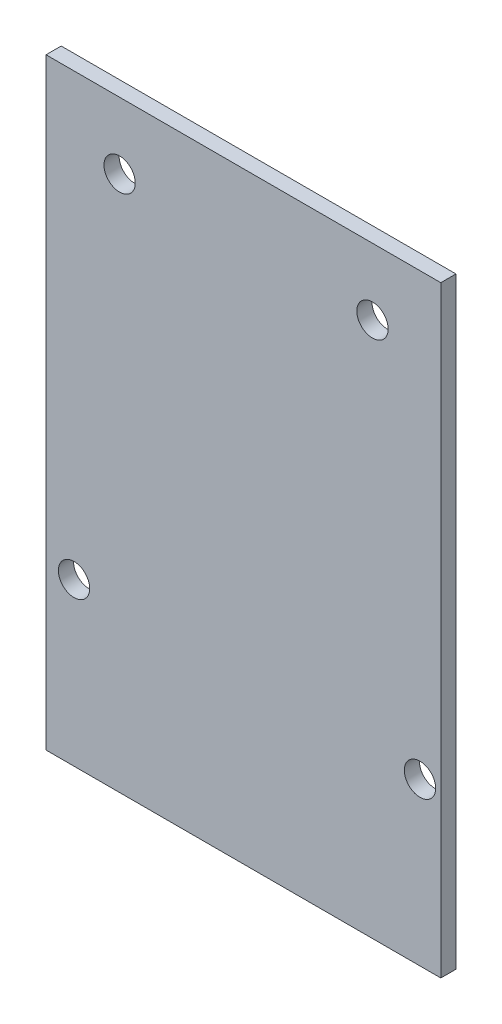
ISO-10303-21;
HEADER;
FILE_DESCRIPTION(('STEP AP214'),'2;1');
FILE_NAME('part.step','',(''),(''),'','','');
FILE_SCHEMA(('AUTOMOTIVE_DESIGN { 1 0 10303 214 1 1 1 1 }'));
ENDSEC;
DATA;
#1=APPLICATION_CONTEXT('core data for automotive mechanical design processes');
#2=APPLICATION_PROTOCOL_DEFINITION('international standard','automotive_design',2000,#1);
#3=PRODUCT_CONTEXT('',#1,'mechanical');
#4=PRODUCT('Part','Part','',(#3));
#5=PRODUCT_RELATED_PRODUCT_CATEGORY('part','',(#4));
#6=PRODUCT_DEFINITION_FORMATION('','',#4);
#7=PRODUCT_DEFINITION_CONTEXT('part definition',#1,'design');
#8=PRODUCT_DEFINITION('design','',#6,#7);
#9=PRODUCT_DEFINITION_SHAPE('','',#8);
#10=(LENGTH_UNIT() NAMED_UNIT(*) SI_UNIT(.MILLI.,.METRE.));
#11=(NAMED_UNIT(*) PLANE_ANGLE_UNIT() SI_UNIT($,.RADIAN.));
#12=(NAMED_UNIT(*) SI_UNIT($,.STERADIAN.) SOLID_ANGLE_UNIT());
#13=UNCERTAINTY_MEASURE_WITH_UNIT(LENGTH_MEASURE(1.E-05),#10,'distance_accuracy_value','');
#14=(GEOMETRIC_REPRESENTATION_CONTEXT(3) GLOBAL_UNCERTAINTY_ASSIGNED_CONTEXT((#13)) GLOBAL_UNIT_ASSIGNED_CONTEXT((#10,
#11,#12)) REPRESENTATION_CONTEXT('',''));
#15=CARTESIAN_POINT('',(0.,0.,0.));
#16=DIRECTION('',(0.,0.,1.));
#17=DIRECTION('',(1.,0.,0.));
#18=AXIS2_PLACEMENT_3D('',#15,#16,#17);
#19=CARTESIAN_POINT('',(2.77,16.,0.));
#20=DIRECTION('',(0.,0.,1.));
#21=DIRECTION('',(1.,0.,0.));
#22=AXIS2_PLACEMENT_3D('',#19,#20,#21);
#23=CYLINDRICAL_SURFACE('',#22,1.55);
#24=CARTESIAN_POINT('',(2.77,16.,1.5));
#25=DIRECTION('',(0.,0.,-1.));
#26=DIRECTION('',(1.,0.,0.));
#27=AXIS2_PLACEMENT_3D('',#24,#25,#26);
#28=CIRCLE('',#27,1.55);
#29=CARTESIAN_POINT('',(1.22,16.,1.5));
#30=VERTEX_POINT('',#29);
#31=EDGE_CURVE('E40',#30,#30,#28,.T.);
#32=ORIENTED_EDGE('',*,*,#31,.F.);
#33=DIRECTION('',(0.,0.,-1.));
#34=VECTOR('',#33,1.);
#35=CARTESIAN_POINT('',(1.22,16.,0.));
#36=LINE('',#35,#34);
#37=CARTESIAN_POINT('',(1.22,16.,0.));
#38=VERTEX_POINT('',#37);
#39=EDGE_CURVE('E11',#30,#38,#36,.T.);
#40=ORIENTED_EDGE('',*,*,#39,.T.);
#41=CARTESIAN_POINT('',(2.77,16.,0.));
#42=DIRECTION('',(0.,0.,-1.));
#43=DIRECTION('',(1.,0.,0.));
#44=AXIS2_PLACEMENT_3D('',#41,#42,#43);
#45=CIRCLE('',#44,1.55);
#46=EDGE_CURVE('E27',#38,#38,#45,.T.);
#47=ORIENTED_EDGE('',*,*,#46,.T.);
#48=ORIENTED_EDGE('',*,*,#39,.F.);
#49=EDGE_LOOP('',(#32,#40,#47,#48));
#50=FACE_BOUND('',#49,.T.);
#51=ADVANCED_FACE('F16',(#50),#23,.F.);
#52=CARTESIAN_POINT('',(32.3,53.,0.));
#53=DIRECTION('',(0.,0.,1.));
#54=DIRECTION('',(1.,0.,0.));
#55=AXIS2_PLACEMENT_3D('',#52,#53,#54);
#56=CYLINDRICAL_SURFACE('',#55,1.55);
#57=CARTESIAN_POINT('',(32.3,53.,1.5));
#58=DIRECTION('',(0.,0.,-1.));
#59=DIRECTION('',(1.,0.,0.));
#60=AXIS2_PLACEMENT_3D('',#57,#58,#59);
#61=CIRCLE('',#60,1.55);
#62=CARTESIAN_POINT('',(30.75,53.,1.5));
#63=VERTEX_POINT('',#62);
#64=EDGE_CURVE('E149',#63,#63,#61,.T.);
#65=ORIENTED_EDGE('',*,*,#64,.F.);
#66=DIRECTION('',(0.,0.,-1.));
#67=VECTOR('',#66,1.);
#68=CARTESIAN_POINT('',(30.75,53.,0.));
#69=LINE('',#68,#67);
#70=CARTESIAN_POINT('',(30.75,53.,0.));
#71=VERTEX_POINT('',#70);
#72=EDGE_CURVE('E123',#63,#71,#69,.T.);
#73=ORIENTED_EDGE('',*,*,#72,.T.);
#74=CARTESIAN_POINT('',(32.3,53.,0.));
#75=DIRECTION('',(0.,0.,-1.));
#76=DIRECTION('',(1.,0.,0.));
#77=AXIS2_PLACEMENT_3D('',#74,#75,#76);
#78=CIRCLE('',#77,1.55);
#79=EDGE_CURVE('E117',#71,#71,#78,.T.);
#80=ORIENTED_EDGE('',*,*,#79,.T.);
#81=ORIENTED_EDGE('',*,*,#72,.F.);
#82=EDGE_LOOP('',(#65,#73,#80,#81));
#83=FACE_BOUND('',#82,.T.);
#84=ADVANCED_FACE('F208',(#83),#56,.F.);
#85=CARTESIAN_POINT('',(37.,16.,0.));
#86=DIRECTION('',(0.,0.,1.));
#87=DIRECTION('',(1.,0.,0.));
#88=AXIS2_PLACEMENT_3D('',#85,#86,#87);
#89=CYLINDRICAL_SURFACE('',#88,1.55);
#90=CARTESIAN_POINT('',(37.,16.,1.5));
#91=DIRECTION('',(0.,0.,-1.));
#92=DIRECTION('',(1.,0.,0.));
#93=AXIS2_PLACEMENT_3D('',#90,#91,#92);
#94=CIRCLE('',#93,1.55);
#95=CARTESIAN_POINT('',(35.45,16.,1.5));
#96=VERTEX_POINT('',#95);
#97=EDGE_CURVE('E115',#96,#96,#94,.T.);
#98=ORIENTED_EDGE('',*,*,#97,.F.);
#99=DIRECTION('',(0.,0.,-1.));
#100=VECTOR('',#99,1.);
#101=CARTESIAN_POINT('',(35.45,16.,0.));
#102=LINE('',#101,#100);
#103=CARTESIAN_POINT('',(35.45,16.,0.));
#104=VERTEX_POINT('',#103);
#105=EDGE_CURVE('E110',#96,#104,#102,.T.);
#106=ORIENTED_EDGE('',*,*,#105,.T.);
#107=CARTESIAN_POINT('',(37.,16.,0.));
#108=DIRECTION('',(0.,0.,-1.));
#109=DIRECTION('',(1.,0.,0.));
#110=AXIS2_PLACEMENT_3D('',#107,#108,#109);
#111=CIRCLE('',#110,1.55);
#112=EDGE_CURVE('E103',#104,#104,#111,.T.);
#113=ORIENTED_EDGE('',*,*,#112,.T.);
#114=ORIENTED_EDGE('',*,*,#105,.F.);
#115=EDGE_LOOP('',(#98,#106,#113,#114));
#116=FACE_BOUND('',#115,.T.);
#117=ADVANCED_FACE('F113',(#116),#89,.F.);
#118=CARTESIAN_POINT('',(7.28,53.,0.));
#119=DIRECTION('',(0.,0.,1.));
#120=DIRECTION('',(1.,0.,0.));
#121=AXIS2_PLACEMENT_3D('',#118,#119,#120);
#122=CYLINDRICAL_SURFACE('',#121,1.55);
#123=CARTESIAN_POINT('',(7.28,53.,1.5));
#124=DIRECTION('',(0.,0.,-1.));
#125=DIRECTION('',(1.,0.,0.));
#126=AXIS2_PLACEMENT_3D('',#123,#124,#125);
#127=CIRCLE('',#126,1.55);
#128=CARTESIAN_POINT('',(5.73,53.,1.5));
#129=VERTEX_POINT('',#128);
#130=EDGE_CURVE('E20',#129,#129,#127,.T.);
#131=ORIENTED_EDGE('',*,*,#130,.F.);
#132=DIRECTION('',(0.,0.,-1.));
#133=VECTOR('',#132,1.);
#134=CARTESIAN_POINT('',(5.73,53.,0.));
#135=LINE('',#134,#133);
#136=CARTESIAN_POINT('',(5.73,53.,0.));
#137=VERTEX_POINT('',#136);
#138=EDGE_CURVE('E111',#129,#137,#135,.T.);
#139=ORIENTED_EDGE('',*,*,#138,.T.);
#140=CARTESIAN_POINT('',(7.28,53.,0.));
#141=DIRECTION('',(0.,0.,-1.));
#142=DIRECTION('',(1.,0.,0.));
#143=AXIS2_PLACEMENT_3D('',#140,#141,#142);
#144=CIRCLE('',#143,1.55);
#145=EDGE_CURVE('E161',#137,#137,#144,.T.);
#146=ORIENTED_EDGE('',*,*,#145,.T.);
#147=ORIENTED_EDGE('',*,*,#138,.F.);
#148=EDGE_LOOP('',(#131,#139,#146,#147));
#149=FACE_BOUND('',#148,.T.);
#150=ADVANCED_FACE('F192',(#149),#122,.F.);
#151=CARTESIAN_POINT('',(39.06,59.58,0.));
#152=DIRECTION('',(0.,1.,0.));
#153=DIRECTION('',(1.,0.,0.));
#154=AXIS2_PLACEMENT_3D('',#151,#152,#153);
#155=PLANE('',#154);
#156=DIRECTION('',(-1.,0.,0.));
#157=VECTOR('',#156,1.);
#158=CARTESIAN_POINT('',(39.06,59.58,0.));
#159=LINE('',#158,#157);
#160=CARTESIAN_POINT('',(39.06,59.58,0.));
#161=VERTEX_POINT('',#160);
#162=CARTESIAN_POINT('',(0.,59.58,0.));
#163=VERTEX_POINT('',#162);
#164=EDGE_CURVE('E147',#161,#163,#159,.T.);
#165=ORIENTED_EDGE('',*,*,#164,.T.);
#166=DIRECTION('',(0.,0.,1.));
#167=VECTOR('',#166,1.);
#168=CARTESIAN_POINT('',(0.,59.58,0.));
#169=LINE('',#168,#167);
#170=CARTESIAN_POINT('',(0.,59.58,1.5));
#171=VERTEX_POINT('',#170);
#172=EDGE_CURVE('E144',#163,#171,#169,.T.);
#173=ORIENTED_EDGE('',*,*,#172,.T.);
#174=DIRECTION('',(-1.,0.,0.));
#175=VECTOR('',#174,1.);
#176=CARTESIAN_POINT('',(39.06,59.58,1.5));
#177=LINE('',#176,#175);
#178=CARTESIAN_POINT('',(39.06,59.58,1.5));
#179=VERTEX_POINT('',#178);
#180=EDGE_CURVE('E83',#179,#171,#177,.T.);
#181=ORIENTED_EDGE('',*,*,#180,.F.);
#182=DIRECTION('',(0.,0.,1.));
#183=VECTOR('',#182,1.);
#184=CARTESIAN_POINT('',(39.06,59.58,0.));
#185=LINE('',#184,#183);
#186=EDGE_CURVE('E165',#161,#179,#185,.T.);
#187=ORIENTED_EDGE('',*,*,#186,.F.);
#188=EDGE_LOOP('',(#165,#173,#181,#187));
#189=FACE_BOUND('',#188,.T.);
#190=ADVANCED_FACE('F18',(#189),#155,.T.);
#191=CARTESIAN_POINT('',(39.06,0.,0.));
#192=DIRECTION('',(1.,0.,0.));
#193=DIRECTION('',(0.,1.,0.));
#194=AXIS2_PLACEMENT_3D('',#191,#192,#193);
#195=PLANE('',#194);
#196=DIRECTION('',(0.,1.,0.));
#197=VECTOR('',#196,1.);
#198=CARTESIAN_POINT('',(39.06,0.,0.));
#199=LINE('',#198,#197);
#200=CARTESIAN_POINT('',(39.06,0.,0.));
#201=VERTEX_POINT('',#200);
#202=EDGE_CURVE('E148',#201,#161,#199,.T.);
#203=ORIENTED_EDGE('',*,*,#202,.T.);
#204=ORIENTED_EDGE('',*,*,#186,.T.);
#205=DIRECTION('',(0.,1.,0.));
#206=VECTOR('',#205,1.);
#207=CARTESIAN_POINT('',(39.06,0.,1.5));
#208=LINE('',#207,#206);
#209=CARTESIAN_POINT('',(39.06,0.,1.5));
#210=VERTEX_POINT('',#209);
#211=EDGE_CURVE('E126',#210,#179,#208,.T.);
#212=ORIENTED_EDGE('',*,*,#211,.F.);
#213=DIRECTION('',(0.,0.,1.));
#214=VECTOR('',#213,1.);
#215=CARTESIAN_POINT('',(39.06,0.,0.));
#216=LINE('',#215,#214);
#217=EDGE_CURVE('E141',#201,#210,#216,.T.);
#218=ORIENTED_EDGE('',*,*,#217,.F.);
#219=EDGE_LOOP('',(#203,#204,#212,#218));
#220=FACE_BOUND('',#219,.T.);
#221=ADVANCED_FACE('F220',(#220),#195,.T.);
#222=CARTESIAN_POINT('',(0.,0.,0.));
#223=DIRECTION('',(0.,-1.,0.));
#224=DIRECTION('',(0.,0.,-1.));
#225=AXIS2_PLACEMENT_3D('',#222,#223,#224);
#226=PLANE('',#225);
#227=DIRECTION('',(1.,0.,0.));
#228=VECTOR('',#227,1.);
#229=CARTESIAN_POINT('',(0.,0.,0.));
#230=LINE('',#229,#228);
#231=CARTESIAN_POINT('',(0.,0.,0.));
#232=VERTEX_POINT('',#231);
#233=EDGE_CURVE('E169',#232,#201,#230,.T.);
#234=ORIENTED_EDGE('',*,*,#233,.T.);
#235=ORIENTED_EDGE('',*,*,#217,.T.);
#236=DIRECTION('',(1.,0.,0.));
#237=VECTOR('',#236,1.);
#238=CARTESIAN_POINT('',(0.,0.,1.5));
#239=LINE('',#238,#237);
#240=CARTESIAN_POINT('',(0.,0.,1.5));
#241=VERTEX_POINT('',#240);
#242=EDGE_CURVE('E129',#241,#210,#239,.T.);
#243=ORIENTED_EDGE('',*,*,#242,.F.);
#244=DIRECTION('',(0.,0.,1.));
#245=VECTOR('',#244,1.);
#246=CARTESIAN_POINT('',(0.,0.,0.));
#247=LINE('',#246,#245);
#248=EDGE_CURVE('E133',#232,#241,#247,.T.);
#249=ORIENTED_EDGE('',*,*,#248,.F.);
#250=EDGE_LOOP('',(#234,#235,#243,#249));
#251=FACE_BOUND('',#250,.T.);
#252=ADVANCED_FACE('F218',(#251),#226,.T.);
#253=CARTESIAN_POINT('',(0.,59.58,0.));
#254=DIRECTION('',(-1.,0.,0.));
#255=DIRECTION('',(0.,0.,1.));
#256=AXIS2_PLACEMENT_3D('',#253,#254,#255);
#257=PLANE('',#256);
#258=DIRECTION('',(0.,-1.,0.));
#259=VECTOR('',#258,1.);
#260=CARTESIAN_POINT('',(0.,59.58,0.));
#261=LINE('',#260,#259);
#262=EDGE_CURVE('E137',#163,#232,#261,.T.);
#263=ORIENTED_EDGE('',*,*,#262,.T.);
#264=ORIENTED_EDGE('',*,*,#248,.T.);
#265=DIRECTION('',(0.,-1.,0.));
#266=VECTOR('',#265,1.);
#267=CARTESIAN_POINT('',(0.,59.58,1.5));
#268=LINE('',#267,#266);
#269=EDGE_CURVE('E130',#171,#241,#268,.T.);
#270=ORIENTED_EDGE('',*,*,#269,.F.);
#271=ORIENTED_EDGE('',*,*,#172,.F.);
#272=EDGE_LOOP('',(#263,#264,#270,#271));
#273=FACE_BOUND('',#272,.T.);
#274=ADVANCED_FACE('F202',(#273),#257,.T.);
#275=CARTESIAN_POINT('',(19.53,29.79,1.5));
#276=DIRECTION('',(0.,0.,1.));
#277=DIRECTION('',(1.,0.,0.));
#278=AXIS2_PLACEMENT_3D('',#275,#276,#277);
#279=PLANE('',#278);
#280=ORIENTED_EDGE('',*,*,#269,.T.);
#281=ORIENTED_EDGE('',*,*,#242,.T.);
#282=ORIENTED_EDGE('',*,*,#211,.T.);
#283=ORIENTED_EDGE('',*,*,#180,.T.);
#284=EDGE_LOOP('',(#280,#281,#282,#283));
#285=FACE_BOUND('',#284,.T.);
#286=ORIENTED_EDGE('',*,*,#130,.T.);
#287=EDGE_LOOP('',(#286));
#288=FACE_BOUND('',#287,.T.);
#289=ORIENTED_EDGE('',*,*,#97,.T.);
#290=EDGE_LOOP('',(#289));
#291=FACE_BOUND('',#290,.T.);
#292=ORIENTED_EDGE('',*,*,#64,.T.);
#293=EDGE_LOOP('',(#292));
#294=FACE_BOUND('',#293,.T.);
#295=ORIENTED_EDGE('',*,*,#31,.T.);
#296=EDGE_LOOP('',(#295));
#297=FACE_BOUND('',#296,.T.);
#298=ADVANCED_FACE('F195',(#285,#288,#291,#294,#297),#279,.T.);
#299=CARTESIAN_POINT('',(19.53,29.79,0.));
#300=DIRECTION('',(0.,0.,1.));
#301=DIRECTION('',(1.,0.,0.));
#302=AXIS2_PLACEMENT_3D('',#299,#300,#301);
#303=PLANE('',#302);
#304=ORIENTED_EDGE('',*,*,#262,.F.);
#305=ORIENTED_EDGE('',*,*,#164,.F.);
#306=ORIENTED_EDGE('',*,*,#202,.F.);
#307=ORIENTED_EDGE('',*,*,#233,.F.);
#308=EDGE_LOOP('',(#304,#305,#306,#307));
#309=FACE_BOUND('',#308,.T.);
#310=ORIENTED_EDGE('',*,*,#145,.F.);
#311=EDGE_LOOP('',(#310));
#312=FACE_BOUND('',#311,.T.);
#313=ORIENTED_EDGE('',*,*,#112,.F.);
#314=EDGE_LOOP('',(#313));
#315=FACE_BOUND('',#314,.T.);
#316=ORIENTED_EDGE('',*,*,#79,.F.);
#317=EDGE_LOOP('',(#316));
#318=FACE_BOUND('',#317,.T.);
#319=ORIENTED_EDGE('',*,*,#46,.F.);
#320=EDGE_LOOP('',(#319));
#321=FACE_BOUND('',#320,.T.);
#322=ADVANCED_FACE('F105',(#309,#312,#315,#318,#321),#303,.F.);
#323=CLOSED_SHELL('',(#51,#84,#117,#150,#190,#221,#252,#274,#298,#322));
#324=MANIFOLD_SOLID_BREP('B1',#323);
#325=ADVANCED_BREP_SHAPE_REPRESENTATION('',(#18,#324),#14);
#326=SHAPE_DEFINITION_REPRESENTATION(#9,#325);
ENDSEC;
END-ISO-10303-21;
